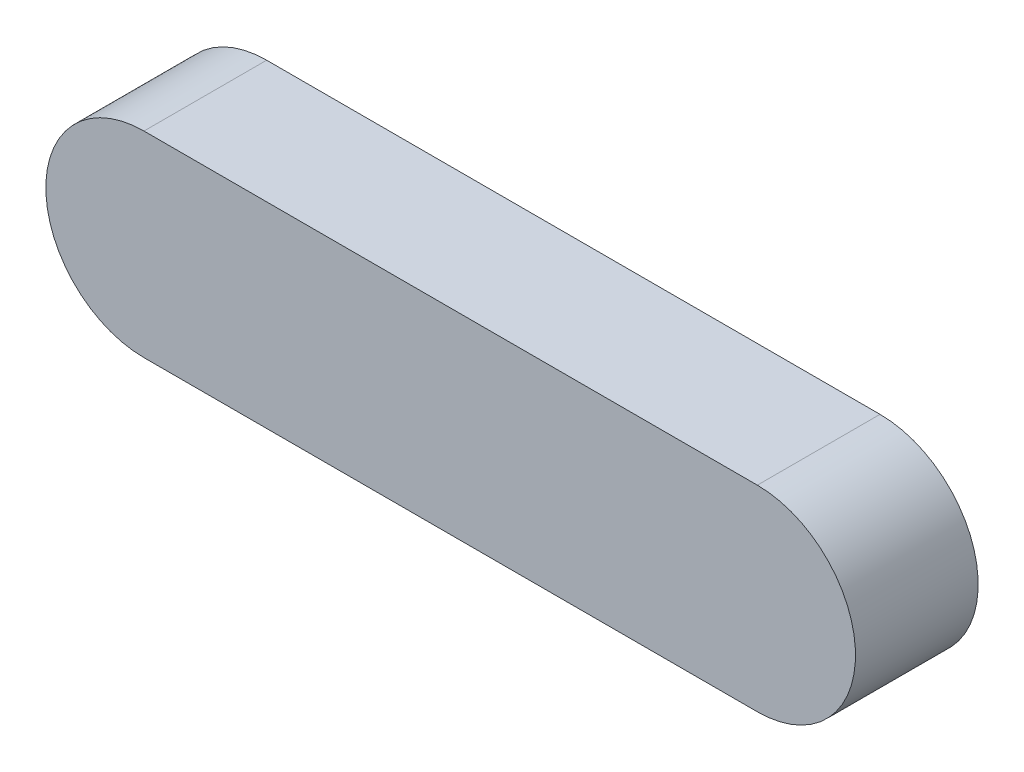
ISO-10303-21;
HEADER;
FILE_DESCRIPTION(('STEP AP214'),'2;1');
FILE_NAME('part.step','',(''),(''),'','','');
FILE_SCHEMA(('AUTOMOTIVE_DESIGN { 1 0 10303 214 1 1 1 1 }'));
ENDSEC;
DATA;
#1=APPLICATION_CONTEXT('core data for automotive mechanical design processes');
#2=APPLICATION_PROTOCOL_DEFINITION('international standard','automotive_design',2000,#1);
#3=PRODUCT_CONTEXT('',#1,'mechanical');
#4=PRODUCT('Part','Part','',(#3));
#5=PRODUCT_RELATED_PRODUCT_CATEGORY('part','',(#4));
#6=PRODUCT_DEFINITION_FORMATION('','',#4);
#7=PRODUCT_DEFINITION_CONTEXT('part definition',#1,'design');
#8=PRODUCT_DEFINITION('design','',#6,#7);
#9=PRODUCT_DEFINITION_SHAPE('','',#8);
#10=(LENGTH_UNIT() NAMED_UNIT(*) SI_UNIT(.MILLI.,.METRE.));
#11=(NAMED_UNIT(*) PLANE_ANGLE_UNIT() SI_UNIT($,.RADIAN.));
#12=(NAMED_UNIT(*) SI_UNIT($,.STERADIAN.) SOLID_ANGLE_UNIT());
#13=UNCERTAINTY_MEASURE_WITH_UNIT(LENGTH_MEASURE(1.E-05),#10,'distance_accuracy_value','');
#14=(GEOMETRIC_REPRESENTATION_CONTEXT(3) GLOBAL_UNCERTAINTY_ASSIGNED_CONTEXT((#13)) GLOBAL_UNIT_ASSIGNED_CONTEXT((#10,
#11,#12)) REPRESENTATION_CONTEXT('',''));
#15=CARTESIAN_POINT('',(0.,0.,0.));
#16=DIRECTION('',(0.,0.,1.));
#17=DIRECTION('',(1.,0.,0.));
#18=AXIS2_PLACEMENT_3D('',#15,#16,#17);
#19=CARTESIAN_POINT('',(-250.,0.,50.));
#20=DIRECTION('',(0.,0.,-1.));
#21=DIRECTION('',(-1.,0.,0.));
#22=AXIS2_PLACEMENT_3D('',#19,#20,#21);
#23=CYLINDRICAL_SURFACE('',#22,40.);
#24=CARTESIAN_POINT('',(-250.,0.,0.));
#25=DIRECTION('',(0.,0.,1.));
#26=DIRECTION('',(1.,0.,0.));
#27=AXIS2_PLACEMENT_3D('',#24,#25,#26);
#28=CIRCLE('',#27,40.);
#29=CARTESIAN_POINT('',(-250.,40.,0.));
#30=VERTEX_POINT('',#29);
#31=CARTESIAN_POINT('',(-250.,-40.,0.));
#32=VERTEX_POINT('',#31);
#33=EDGE_CURVE('E100',#30,#32,#28,.T.);
#34=ORIENTED_EDGE('',*,*,#33,.T.);
#35=DIRECTION('',(0.,0.,-1.));
#36=VECTOR('',#35,1.);
#37=CARTESIAN_POINT('',(-250.,-40.,50.));
#38=LINE('',#37,#36);
#39=CARTESIAN_POINT('',(-250.,-40.,50.));
#40=VERTEX_POINT('',#39);
#41=EDGE_CURVE('E57',#40,#32,#38,.T.);
#42=ORIENTED_EDGE('',*,*,#41,.F.);
#43=CARTESIAN_POINT('',(-250.,0.,50.));
#44=DIRECTION('',(0.,0.,1.));
#45=DIRECTION('',(1.,0.,0.));
#46=AXIS2_PLACEMENT_3D('',#43,#44,#45);
#47=CIRCLE('',#46,40.);
#48=CARTESIAN_POINT('',(-250.,40.,50.));
#49=VERTEX_POINT('',#48);
#50=EDGE_CURVE('E91',#49,#40,#47,.T.);
#51=ORIENTED_EDGE('',*,*,#50,.F.);
#52=DIRECTION('',(0.,0.,-1.));
#53=VECTOR('',#52,1.);
#54=CARTESIAN_POINT('',(-250.,40.,50.));
#55=LINE('',#54,#53);
#56=EDGE_CURVE('E12',#49,#30,#55,.T.);
#57=ORIENTED_EDGE('',*,*,#56,.T.);
#58=EDGE_LOOP('',(#34,#42,#51,#57));
#59=FACE_BOUND('',#58,.T.);
#60=ADVANCED_FACE('F48',(#59),#23,.T.);
#61=CARTESIAN_POINT('',(0.,-40.,50.));
#62=DIRECTION('',(0.,-1.,0.));
#63=DIRECTION('',(1.,0.,0.));
#64=AXIS2_PLACEMENT_3D('',#61,#62,#63);
#65=PLANE('',#64);
#66=DIRECTION('',(-1.,0.,0.));
#67=VECTOR('',#66,1.);
#68=CARTESIAN_POINT('',(0.,-40.,0.));
#69=LINE('',#68,#67);
#70=CARTESIAN_POINT('',(0.,-40.,0.));
#71=VERTEX_POINT('',#70);
#72=EDGE_CURVE('E115',#71,#32,#69,.T.);
#73=ORIENTED_EDGE('',*,*,#72,.F.);
#74=DIRECTION('',(0.,0.,-1.));
#75=VECTOR('',#74,1.);
#76=CARTESIAN_POINT('',(0.,-40.,50.));
#77=LINE('',#76,#75);
#78=CARTESIAN_POINT('',(0.,-40.,50.));
#79=VERTEX_POINT('',#78);
#80=EDGE_CURVE('E81',#79,#71,#77,.T.);
#81=ORIENTED_EDGE('',*,*,#80,.F.);
#82=DIRECTION('',(-1.,0.,0.));
#83=VECTOR('',#82,1.);
#84=CARTESIAN_POINT('',(0.,-40.,50.));
#85=LINE('',#84,#83);
#86=EDGE_CURVE('E94',#79,#40,#85,.T.);
#87=ORIENTED_EDGE('',*,*,#86,.T.);
#88=ORIENTED_EDGE('',*,*,#41,.T.);
#89=EDGE_LOOP('',(#73,#81,#87,#88));
#90=FACE_BOUND('',#89,.T.);
#91=ADVANCED_FACE('F104',(#90),#65,.T.);
#92=CARTESIAN_POINT('',(0.,0.,50.));
#93=DIRECTION('',(0.,0.,-1.));
#94=DIRECTION('',(-1.,0.,0.));
#95=AXIS2_PLACEMENT_3D('',#92,#93,#94);
#96=CYLINDRICAL_SURFACE('',#95,40.);
#97=CARTESIAN_POINT('',(0.,0.,0.));
#98=DIRECTION('',(0.,0.,1.));
#99=DIRECTION('',(1.,0.,0.));
#100=AXIS2_PLACEMENT_3D('',#97,#98,#99);
#101=CIRCLE('',#100,40.);
#102=CARTESIAN_POINT('',(0.,40.,0.));
#103=VERTEX_POINT('',#102);
#104=EDGE_CURVE('E84',#71,#103,#101,.T.);
#105=ORIENTED_EDGE('',*,*,#104,.T.);
#106=DIRECTION('',(0.,0.,-1.));
#107=VECTOR('',#106,1.);
#108=CARTESIAN_POINT('',(0.,40.,50.));
#109=LINE('',#108,#107);
#110=CARTESIAN_POINT('',(0.,40.,50.));
#111=VERTEX_POINT('',#110);
#112=EDGE_CURVE('E106',#111,#103,#109,.T.);
#113=ORIENTED_EDGE('',*,*,#112,.F.);
#114=CARTESIAN_POINT('',(0.,0.,50.));
#115=DIRECTION('',(0.,0.,1.));
#116=DIRECTION('',(1.,0.,0.));
#117=AXIS2_PLACEMENT_3D('',#114,#115,#116);
#118=CIRCLE('',#117,40.);
#119=EDGE_CURVE('E65',#79,#111,#118,.T.);
#120=ORIENTED_EDGE('',*,*,#119,.F.);
#121=ORIENTED_EDGE('',*,*,#80,.T.);
#122=EDGE_LOOP('',(#105,#113,#120,#121));
#123=FACE_BOUND('',#122,.T.);
#124=ADVANCED_FACE('F132',(#123),#96,.T.);
#125=CARTESIAN_POINT('',(0.,40.,50.));
#126=DIRECTION('',(0.,-1.,0.));
#127=DIRECTION('',(1.,0.,0.));
#128=AXIS2_PLACEMENT_3D('',#125,#126,#127);
#129=PLANE('',#128);
#130=DIRECTION('',(-1.,0.,0.));
#131=VECTOR('',#130,1.);
#132=CARTESIAN_POINT('',(0.,40.,0.));
#133=LINE('',#132,#131);
#134=EDGE_CURVE('E110',#103,#30,#133,.T.);
#135=ORIENTED_EDGE('',*,*,#134,.T.);
#136=ORIENTED_EDGE('',*,*,#56,.F.);
#137=DIRECTION('',(-1.,0.,0.));
#138=VECTOR('',#137,1.);
#139=CARTESIAN_POINT('',(0.,40.,50.));
#140=LINE('',#139,#138);
#141=EDGE_CURVE('E96',#111,#49,#140,.T.);
#142=ORIENTED_EDGE('',*,*,#141,.F.);
#143=ORIENTED_EDGE('',*,*,#112,.T.);
#144=EDGE_LOOP('',(#135,#136,#142,#143));
#145=FACE_BOUND('',#144,.T.);
#146=ADVANCED_FACE('F50',(#145),#129,.F.);
#147=CARTESIAN_POINT('',(0.,0.,0.));
#148=DIRECTION('',(0.,0.,1.));
#149=DIRECTION('',(1.,0.,0.));
#150=AXIS2_PLACEMENT_3D('',#147,#148,#149);
#151=PLANE('',#150);
#152=CARTESIAN_POINT('',(0.,0.,0.));
#153=DIRECTION('',(0.,0.,1.));
#154=DIRECTION('',(1.,0.,0.));
#155=AXIS2_PLACEMENT_3D('',#152,#153,#154);
#156=CIRCLE('',#155,30.);
#157=CARTESIAN_POINT('',(30.,0.,0.));
#158=VERTEX_POINT('',#157);
#159=EDGE_CURVE('E268',#158,#158,#156,.T.);
#160=ORIENTED_EDGE('',*,*,#159,.T.);
#161=EDGE_LOOP('',(#160));
#162=FACE_BOUND('',#161,.T.);
#163=CARTESIAN_POINT('',(-62.5,0.,0.));
#164=DIRECTION('',(0.,0.,1.));
#165=DIRECTION('',(1.,0.,0.));
#166=AXIS2_PLACEMENT_3D('',#163,#164,#165);
#167=CIRCLE('',#166,30.);
#168=CARTESIAN_POINT('',(-32.5,0.,0.));
#169=VERTEX_POINT('',#168);
#170=EDGE_CURVE('E275',#169,#169,#167,.T.);
#171=ORIENTED_EDGE('',*,*,#170,.T.);
#172=EDGE_LOOP('',(#171));
#173=FACE_BOUND('',#172,.T.);
#174=CARTESIAN_POINT('',(-125.,0.,0.));
#175=DIRECTION('',(0.,0.,1.));
#176=DIRECTION('',(1.,0.,0.));
#177=AXIS2_PLACEMENT_3D('',#174,#175,#176);
#178=CIRCLE('',#177,30.);
#179=CARTESIAN_POINT('',(-95.,0.,0.));
#180=VERTEX_POINT('',#179);
#181=EDGE_CURVE('E281',#180,#180,#178,.T.);
#182=ORIENTED_EDGE('',*,*,#181,.T.);
#183=EDGE_LOOP('',(#182));
#184=FACE_BOUND('',#183,.T.);
#185=CARTESIAN_POINT('',(-187.5,0.,0.));
#186=DIRECTION('',(0.,0.,1.));
#187=DIRECTION('',(1.,0.,0.));
#188=AXIS2_PLACEMENT_3D('',#185,#186,#187);
#189=CIRCLE('',#188,30.);
#190=CARTESIAN_POINT('',(-157.5,0.,0.));
#191=VERTEX_POINT('',#190);
#192=EDGE_CURVE('E287',#191,#191,#189,.T.);
#193=ORIENTED_EDGE('',*,*,#192,.T.);
#194=EDGE_LOOP('',(#193));
#195=FACE_BOUND('',#194,.T.);
#196=CARTESIAN_POINT('',(-250.,0.,0.));
#197=DIRECTION('',(0.,0.,1.));
#198=DIRECTION('',(1.,0.,0.));
#199=AXIS2_PLACEMENT_3D('',#196,#197,#198);
#200=CIRCLE('',#199,30.);
#201=CARTESIAN_POINT('',(-220.,0.,0.));
#202=VERTEX_POINT('',#201);
#203=EDGE_CURVE('E293',#202,#202,#200,.T.);
#204=ORIENTED_EDGE('',*,*,#203,.T.);
#205=EDGE_LOOP('',(#204));
#206=FACE_BOUND('',#205,.T.);
#207=ORIENTED_EDGE('',*,*,#134,.F.);
#208=ORIENTED_EDGE('',*,*,#104,.F.);
#209=ORIENTED_EDGE('',*,*,#72,.T.);
#210=ORIENTED_EDGE('',*,*,#33,.F.);
#211=EDGE_LOOP('',(#207,#208,#209,#210));
#212=FACE_BOUND('',#211,.T.);
#213=ADVANCED_FACE('F122',(#162,#173,#184,#195,#206,#212),#151,.F.);
#214=CARTESIAN_POINT('',(0.,0.,50.));
#215=DIRECTION('',(0.,0.,1.));
#216=DIRECTION('',(1.,0.,0.));
#217=AXIS2_PLACEMENT_3D('',#214,#215,#216);
#218=PLANE('',#217);
#219=ORIENTED_EDGE('',*,*,#141,.T.);
#220=ORIENTED_EDGE('',*,*,#50,.T.);
#221=ORIENTED_EDGE('',*,*,#86,.F.);
#222=ORIENTED_EDGE('',*,*,#119,.T.);
#223=EDGE_LOOP('',(#219,#220,#221,#222));
#224=FACE_BOUND('',#223,.T.);
#225=ADVANCED_FACE('F92',(#224),#218,.T.);
#226=CARTESIAN_POINT('',(-250.,0.,40.));
#227=DIRECTION('',(0.,0.,-1.));
#228=DIRECTION('',(-1.,0.,0.));
#229=AXIS2_PLACEMENT_3D('',#226,#227,#228);
#230=CYLINDRICAL_SURFACE('',#229,30.);
#231=CARTESIAN_POINT('',(-250.,0.,40.));
#232=DIRECTION('',(0.,0.,1.));
#233=DIRECTION('',(1.,0.,0.));
#234=AXIS2_PLACEMENT_3D('',#231,#232,#233);
#235=CIRCLE('',#234,30.);
#236=CARTESIAN_POINT('',(-220.,0.,40.));
#237=VERTEX_POINT('',#236);
#238=EDGE_CURVE('E290',#237,#237,#235,.T.);
#239=ORIENTED_EDGE('',*,*,#238,.T.);
#240=EDGE_LOOP('',(#239));
#241=FACE_BOUND('',#240,.T.);
#242=ORIENTED_EDGE('',*,*,#203,.F.);
#243=EDGE_LOOP('',(#242));
#244=FACE_BOUND('',#243,.T.);
#245=ADVANCED_FACE('F130',(#241,#244),#230,.F.);
#246=CARTESIAN_POINT('',(0.,0.,40.));
#247=DIRECTION('',(0.,0.,1.));
#248=DIRECTION('',(1.,0.,0.));
#249=AXIS2_PLACEMENT_3D('',#246,#247,#248);
#250=PLANE('',#249);
#251=ORIENTED_EDGE('',*,*,#238,.F.);
#252=EDGE_LOOP('',(#251));
#253=FACE_BOUND('',#252,.T.);
#254=ADVANCED_FACE('F169',(#253),#250,.F.);
#255=CARTESIAN_POINT('',(-187.5,0.,40.));
#256=DIRECTION('',(0.,0.,-1.));
#257=DIRECTION('',(-1.,0.,0.));
#258=AXIS2_PLACEMENT_3D('',#255,#256,#257);
#259=CYLINDRICAL_SURFACE('',#258,30.);
#260=CARTESIAN_POINT('',(-187.5,0.,40.));
#261=DIRECTION('',(0.,0.,1.));
#262=DIRECTION('',(1.,0.,0.));
#263=AXIS2_PLACEMENT_3D('',#260,#261,#262);
#264=CIRCLE('',#263,30.);
#265=CARTESIAN_POINT('',(-157.5,0.,40.));
#266=VERTEX_POINT('',#265);
#267=EDGE_CURVE('E284',#266,#266,#264,.T.);
#268=ORIENTED_EDGE('',*,*,#267,.T.);
#269=EDGE_LOOP('',(#268));
#270=FACE_BOUND('',#269,.T.);
#271=ORIENTED_EDGE('',*,*,#192,.F.);
#272=EDGE_LOOP('',(#271));
#273=FACE_BOUND('',#272,.T.);
#274=ADVANCED_FACE('F179',(#270,#273),#259,.F.);
#275=CARTESIAN_POINT('',(0.,0.,40.));
#276=DIRECTION('',(0.,0.,1.));
#277=DIRECTION('',(1.,0.,0.));
#278=AXIS2_PLACEMENT_3D('',#275,#276,#277);
#279=PLANE('',#278);
#280=ORIENTED_EDGE('',*,*,#267,.F.);
#281=EDGE_LOOP('',(#280));
#282=FACE_BOUND('',#281,.T.);
#283=ADVANCED_FACE('F189',(#282),#279,.F.);
#284=CARTESIAN_POINT('',(-125.,0.,40.));
#285=DIRECTION('',(0.,0.,-1.));
#286=DIRECTION('',(-1.,0.,0.));
#287=AXIS2_PLACEMENT_3D('',#284,#285,#286);
#288=CYLINDRICAL_SURFACE('',#287,30.);
#289=CARTESIAN_POINT('',(-125.,0.,40.));
#290=DIRECTION('',(0.,0.,1.));
#291=DIRECTION('',(1.,0.,0.));
#292=AXIS2_PLACEMENT_3D('',#289,#290,#291);
#293=CIRCLE('',#292,30.);
#294=CARTESIAN_POINT('',(-95.,0.,40.));
#295=VERTEX_POINT('',#294);
#296=EDGE_CURVE('E278',#295,#295,#293,.T.);
#297=ORIENTED_EDGE('',*,*,#296,.T.);
#298=EDGE_LOOP('',(#297));
#299=FACE_BOUND('',#298,.T.);
#300=ORIENTED_EDGE('',*,*,#181,.F.);
#301=EDGE_LOOP('',(#300));
#302=FACE_BOUND('',#301,.T.);
#303=ADVANCED_FACE('F200',(#299,#302),#288,.F.);
#304=CARTESIAN_POINT('',(0.,0.,40.));
#305=DIRECTION('',(0.,0.,1.));
#306=DIRECTION('',(1.,0.,0.));
#307=AXIS2_PLACEMENT_3D('',#304,#305,#306);
#308=PLANE('',#307);
#309=ORIENTED_EDGE('',*,*,#296,.F.);
#310=EDGE_LOOP('',(#309));
#311=FACE_BOUND('',#310,.T.);
#312=ADVANCED_FACE('F210',(#311),#308,.F.);
#313=CARTESIAN_POINT('',(-62.5,0.,40.));
#314=DIRECTION('',(0.,0.,-1.));
#315=DIRECTION('',(-1.,0.,0.));
#316=AXIS2_PLACEMENT_3D('',#313,#314,#315);
#317=CYLINDRICAL_SURFACE('',#316,30.);
#318=CARTESIAN_POINT('',(-62.5,0.,40.));
#319=DIRECTION('',(0.,0.,1.));
#320=DIRECTION('',(1.,0.,0.));
#321=AXIS2_PLACEMENT_3D('',#318,#319,#320);
#322=CIRCLE('',#321,30.);
#323=CARTESIAN_POINT('',(-32.5,0.,40.));
#324=VERTEX_POINT('',#323);
#325=EDGE_CURVE('E270',#324,#324,#322,.T.);
#326=ORIENTED_EDGE('',*,*,#325,.T.);
#327=EDGE_LOOP('',(#326));
#328=FACE_BOUND('',#327,.T.);
#329=ORIENTED_EDGE('',*,*,#170,.F.);
#330=EDGE_LOOP('',(#329));
#331=FACE_BOUND('',#330,.T.);
#332=ADVANCED_FACE('F221',(#328,#331),#317,.F.);
#333=CARTESIAN_POINT('',(0.,0.,40.));
#334=DIRECTION('',(0.,0.,1.));
#335=DIRECTION('',(1.,0.,0.));
#336=AXIS2_PLACEMENT_3D('',#333,#334,#335);
#337=PLANE('',#336);
#338=ORIENTED_EDGE('',*,*,#325,.F.);
#339=EDGE_LOOP('',(#338));
#340=FACE_BOUND('',#339,.T.);
#341=ADVANCED_FACE('F231',(#340),#337,.F.);
#342=CARTESIAN_POINT('',(0.,0.,40.));
#343=DIRECTION('',(0.,0.,-1.));
#344=DIRECTION('',(-1.,0.,0.));
#345=AXIS2_PLACEMENT_3D('',#342,#343,#344);
#346=CYLINDRICAL_SURFACE('',#345,30.);
#347=CARTESIAN_POINT('',(0.,0.,40.));
#348=DIRECTION('',(0.,0.,1.));
#349=DIRECTION('',(1.,0.,0.));
#350=AXIS2_PLACEMENT_3D('',#347,#348,#349);
#351=CIRCLE('',#350,30.);
#352=CARTESIAN_POINT('',(30.,0.,40.));
#353=VERTEX_POINT('',#352);
#354=EDGE_CURVE('E113',#353,#353,#351,.T.);
#355=ORIENTED_EDGE('',*,*,#354,.T.);
#356=EDGE_LOOP('',(#355));
#357=FACE_BOUND('',#356,.T.);
#358=ORIENTED_EDGE('',*,*,#159,.F.);
#359=EDGE_LOOP('',(#358));
#360=FACE_BOUND('',#359,.T.);
#361=ADVANCED_FACE('F242',(#357,#360),#346,.F.);
#362=CARTESIAN_POINT('',(0.,0.,40.));
#363=DIRECTION('',(0.,0.,1.));
#364=DIRECTION('',(1.,0.,0.));
#365=AXIS2_PLACEMENT_3D('',#362,#363,#364);
#366=PLANE('',#365);
#367=ORIENTED_EDGE('',*,*,#354,.F.);
#368=EDGE_LOOP('',(#367));
#369=FACE_BOUND('',#368,.T.);
#370=ADVANCED_FACE('F252',(#369),#366,.F.);
#371=CLOSED_SHELL('',(#60,#91,#124,#146,#213,#225,#245,#254,#274,#283,#303,#312,#332,#341,#361,#370));
#372=MANIFOLD_SOLID_BREP('B2',#371);
#373=ADVANCED_BREP_SHAPE_REPRESENTATION('',(#18,#372),#14);
#374=SHAPE_DEFINITION_REPRESENTATION(#9,#373);
ENDSEC;
END-ISO-10303-21;
